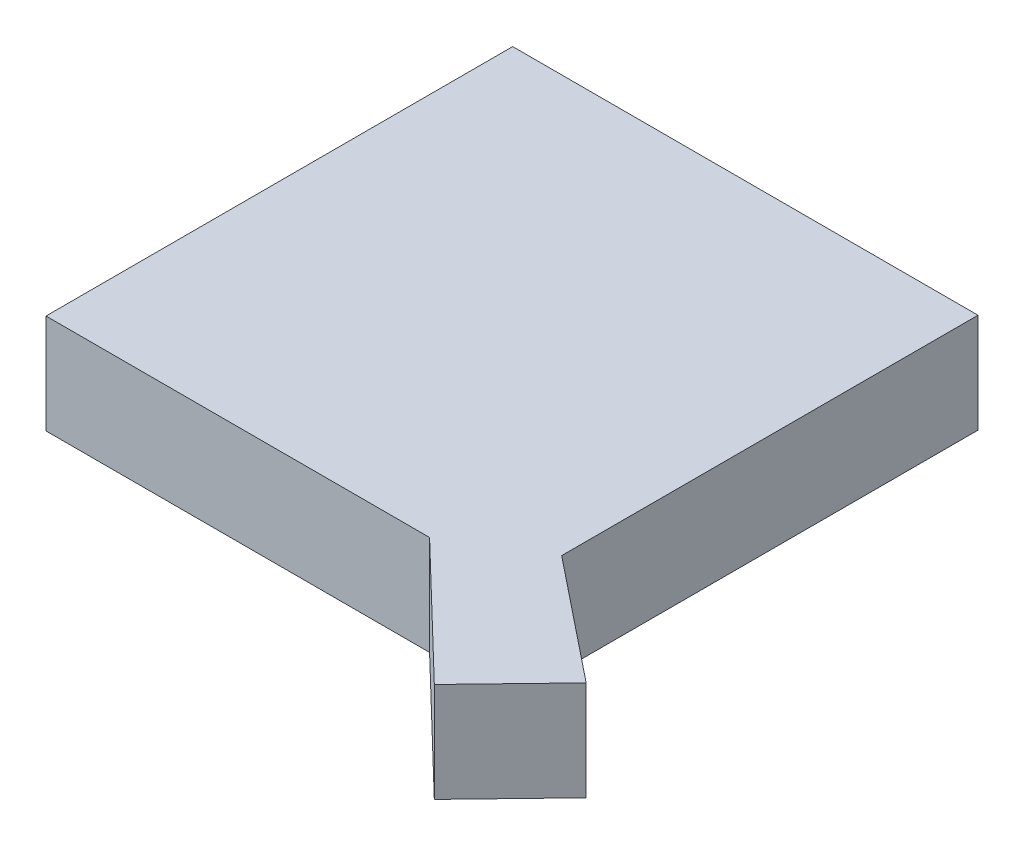
ISO-10303-21;
HEADER;
FILE_DESCRIPTION(('STEP AP214'),'2;1');
FILE_NAME('part.step','',(''),(''),'','','');
FILE_SCHEMA(('AUTOMOTIVE_DESIGN { 1 0 10303 214 1 1 1 1 }'));
ENDSEC;
DATA;
#1=APPLICATION_CONTEXT('core data for automotive mechanical design processes');
#2=APPLICATION_PROTOCOL_DEFINITION('international standard','automotive_design',2000,#1);
#3=PRODUCT_CONTEXT('',#1,'mechanical');
#4=PRODUCT('Part','Part','',(#3));
#5=PRODUCT_RELATED_PRODUCT_CATEGORY('part','',(#4));
#6=PRODUCT_DEFINITION_FORMATION('','',#4);
#7=PRODUCT_DEFINITION_CONTEXT('part definition',#1,'design');
#8=PRODUCT_DEFINITION('design','',#6,#7);
#9=PRODUCT_DEFINITION_SHAPE('','',#8);
#10=(LENGTH_UNIT() NAMED_UNIT(*) SI_UNIT(.MILLI.,.METRE.));
#11=(NAMED_UNIT(*) PLANE_ANGLE_UNIT() SI_UNIT($,.RADIAN.));
#12=(NAMED_UNIT(*) SI_UNIT($,.STERADIAN.) SOLID_ANGLE_UNIT());
#13=UNCERTAINTY_MEASURE_WITH_UNIT(LENGTH_MEASURE(1.E-05),#10,'distance_accuracy_value','');
#14=(GEOMETRIC_REPRESENTATION_CONTEXT(3) GLOBAL_UNCERTAINTY_ASSIGNED_CONTEXT((#13)) GLOBAL_UNIT_ASSIGNED_CONTEXT((#10,
#11,#12)) REPRESENTATION_CONTEXT('',''));
#15=CARTESIAN_POINT('',(0.,0.,0.));
#16=DIRECTION('',(0.,0.,1.));
#17=DIRECTION('',(1.,0.,0.));
#18=AXIS2_PLACEMENT_3D('',#15,#16,#17);
#19=CARTESIAN_POINT('',(38.5326085246113,10.,0.));
#20=DIRECTION('',(0.,0.,-1.));
#21=DIRECTION('',(-1.,0.,0.));
#22=AXIS2_PLACEMENT_3D('',#19,#20,#21);
#23=PLANE('',#22);
#24=DIRECTION('',(1.,0.,0.));
#25=VECTOR('',#24,1.);
#26=CARTESIAN_POINT('',(38.5326085246113,0.,0.));
#27=LINE('',#26,#25);
#28=CARTESIAN_POINT('',(0.,0.,0.));
#29=VERTEX_POINT('',#28);
#30=CARTESIAN_POINT('',(38.5326085246113,0.,0.));
#31=VERTEX_POINT('',#30);
#32=EDGE_CURVE('E123',#29,#31,#27,.T.);
#33=ORIENTED_EDGE('',*,*,#32,.T.);
#34=DIRECTION('',(0.,-1.,0.));
#35=VECTOR('',#34,1.);
#36=CARTESIAN_POINT('',(38.5326085246113,10.,0.));
#37=LINE('',#36,#35);
#38=CARTESIAN_POINT('',(38.5326085246113,10.,0.));
#39=VERTEX_POINT('',#38);
#40=EDGE_CURVE('E11',#39,#31,#37,.T.);
#41=ORIENTED_EDGE('',*,*,#40,.F.);
#42=DIRECTION('',(1.,0.,0.));
#43=VECTOR('',#42,1.);
#44=CARTESIAN_POINT('',(38.5326085246113,10.,0.));
#45=LINE('',#44,#43);
#46=CARTESIAN_POINT('',(0.,10.,0.));
#47=VERTEX_POINT('',#46);
#48=EDGE_CURVE('E135',#47,#39,#45,.T.);
#49=ORIENTED_EDGE('',*,*,#48,.F.);
#50=DIRECTION('',(0.,-1.,0.));
#51=VECTOR('',#50,1.);
#52=CARTESIAN_POINT('',(0.,10.,0.));
#53=LINE('',#52,#51);
#54=EDGE_CURVE('E119',#47,#29,#53,.T.);
#55=ORIENTED_EDGE('',*,*,#54,.T.);
#56=EDGE_LOOP('',(#33,#41,#49,#55));
#57=FACE_BOUND('',#56,.T.);
#58=ADVANCED_FACE('F33',(#57),#23,.F.);
#59=CARTESIAN_POINT('',(51.5617212995141,10.,12.5523797791142));
#60=DIRECTION('',(0.693808773732824,0.,-0.720159277862442));
#61=DIRECTION('',(-0.720159277862442,0.,-0.693808773732824));
#62=AXIS2_PLACEMENT_3D('',#59,#60,#61);
#63=PLANE('',#62);
#64=DIRECTION('',(0.720159277862442,0.,0.693808773732824));
#65=VECTOR('',#64,1.);
#66=CARTESIAN_POINT('',(51.5617212995141,0.,12.5523797791142));
#67=LINE('',#66,#65);
#68=CARTESIAN_POINT('',(51.5617212995141,0.,12.5523797791142));
#69=VERTEX_POINT('',#68);
#70=EDGE_CURVE('E126',#31,#69,#67,.T.);
#71=ORIENTED_EDGE('',*,*,#70,.T.);
#72=DIRECTION('',(0.,-1.,0.));
#73=VECTOR('',#72,1.);
#74=CARTESIAN_POINT('',(51.5617212995141,10.,12.5523797791142));
#75=LINE('',#74,#73);
#76=CARTESIAN_POINT('',(51.5617212995141,10.,12.5523797791142));
#77=VERTEX_POINT('',#76);
#78=EDGE_CURVE('E41',#77,#69,#75,.T.);
#79=ORIENTED_EDGE('',*,*,#78,.F.);
#80=DIRECTION('',(0.720159277862442,0.,0.693808773732824));
#81=VECTOR('',#80,1.);
#82=CARTESIAN_POINT('',(51.5617212995141,10.,12.5523797791142));
#83=LINE('',#82,#81);
#84=EDGE_CURVE('E89',#39,#77,#83,.T.);
#85=ORIENTED_EDGE('',*,*,#84,.F.);
#86=ORIENTED_EDGE('',*,*,#40,.T.);
#87=EDGE_LOOP('',(#71,#79,#85,#86));
#88=FACE_BOUND('',#87,.T.);
#89=ADVANCED_FACE('F160',(#88),#63,.F.);
#90=CARTESIAN_POINT('',(59.0460290778687,10.,4.7838218002903));
#91=DIRECTION('',(-0.720159277862443,0.,-0.693808773732824));
#92=DIRECTION('',(-0.693808773732824,0.,0.720159277862443));
#93=AXIS2_PLACEMENT_3D('',#90,#91,#92);
#94=PLANE('',#93);
#95=DIRECTION('',(0.693808773732824,0.,-0.720159277862443));
#96=VECTOR('',#95,1.);
#97=CARTESIAN_POINT('',(59.0460290778687,0.,4.7838218002903));
#98=LINE('',#97,#96);
#99=CARTESIAN_POINT('',(59.0460290778687,0.,4.7838218002903));
#100=VERTEX_POINT('',#99);
#101=EDGE_CURVE('E128',#69,#100,#98,.T.);
#102=ORIENTED_EDGE('',*,*,#101,.T.);
#103=DIRECTION('',(0.,-1.,0.));
#104=VECTOR('',#103,1.);
#105=CARTESIAN_POINT('',(59.0460290778687,10.,4.7838218002903));
#106=LINE('',#105,#104);
#107=CARTESIAN_POINT('',(59.0460290778687,10.,4.7838218002903));
#108=VERTEX_POINT('',#107);
#109=EDGE_CURVE('E139',#108,#100,#106,.T.);
#110=ORIENTED_EDGE('',*,*,#109,.F.);
#111=DIRECTION('',(0.693808773732824,0.,-0.720159277862443));
#112=VECTOR('',#111,1.);
#113=CARTESIAN_POINT('',(59.0460290778687,10.,4.7838218002903));
#114=LINE('',#113,#112);
#115=EDGE_CURVE('E147',#77,#108,#114,.T.);
#116=ORIENTED_EDGE('',*,*,#115,.F.);
#117=ORIENTED_EDGE('',*,*,#78,.T.);
#118=EDGE_LOOP('',(#102,#110,#116,#117));
#119=FACE_BOUND('',#118,.T.);
#120=ADVANCED_FACE('F145',(#119),#94,.F.);
#121=CARTESIAN_POINT('',(46.7447730199794,10.,-5.05718304602115));
#122=DIRECTION('',(-0.624695047554425,0.,0.78086880944303));
#123=DIRECTION('',(0.78086880944303,0.,0.624695047554425));
#124=AXIS2_PLACEMENT_3D('',#121,#122,#123);
#125=PLANE('',#124);
#126=DIRECTION('',(-0.78086880944303,0.,-0.624695047554425));
#127=VECTOR('',#126,1.);
#128=CARTESIAN_POINT('',(46.7447730199794,0.,-5.05718304602115));
#129=LINE('',#128,#127);
#130=CARTESIAN_POINT('',(46.7447730199794,0.,-5.05718304602115));
#131=VERTEX_POINT('',#130);
#132=EDGE_CURVE('E130',#100,#131,#129,.T.);
#133=ORIENTED_EDGE('',*,*,#132,.T.);
#134=DIRECTION('',(0.,-1.,0.));
#135=VECTOR('',#134,1.);
#136=CARTESIAN_POINT('',(46.7447730199794,10.,-5.05718304602115));
#137=LINE('',#136,#135);
#138=CARTESIAN_POINT('',(46.7447730199794,10.,-5.05718304602115));
#139=VERTEX_POINT('',#138);
#140=EDGE_CURVE('E114',#139,#131,#137,.T.);
#141=ORIENTED_EDGE('',*,*,#140,.F.);
#142=DIRECTION('',(-0.78086880944303,0.,-0.624695047554425));
#143=VECTOR('',#142,1.);
#144=CARTESIAN_POINT('',(46.7447730199794,10.,-5.05718304602115));
#145=LINE('',#144,#143);
#146=EDGE_CURVE('E105',#108,#139,#145,.T.);
#147=ORIENTED_EDGE('',*,*,#146,.F.);
#148=ORIENTED_EDGE('',*,*,#109,.T.);
#149=EDGE_LOOP('',(#133,#141,#147,#148));
#150=FACE_BOUND('',#149,.T.);
#151=ADVANCED_FACE('F153',(#150),#125,.F.);
#152=CARTESIAN_POINT('',(46.7447730199794,10.,-46.8814536428449));
#153=DIRECTION('',(-1.,0.,0.));
#154=DIRECTION('',(0.,0.,1.));
#155=AXIS2_PLACEMENT_3D('',#152,#153,#154);
#156=PLANE('',#155);
#157=DIRECTION('',(0.,0.,-1.));
#158=VECTOR('',#157,1.);
#159=CARTESIAN_POINT('',(46.7447730199794,0.,-46.8814536428449));
#160=LINE('',#159,#158);
#161=CARTESIAN_POINT('',(46.7447730199794,0.,-46.8814536428449));
#162=VERTEX_POINT('',#161);
#163=EDGE_CURVE('E113',#131,#162,#160,.T.);
#164=ORIENTED_EDGE('',*,*,#163,.T.);
#165=DIRECTION('',(0.,-1.,0.));
#166=VECTOR('',#165,1.);
#167=CARTESIAN_POINT('',(46.7447730199794,10.,-46.8814536428449));
#168=LINE('',#167,#166);
#169=CARTESIAN_POINT('',(46.7447730199794,10.,-46.8814536428449));
#170=VERTEX_POINT('',#169);
#171=EDGE_CURVE('E110',#170,#162,#168,.T.);
#172=ORIENTED_EDGE('',*,*,#171,.F.);
#173=DIRECTION('',(0.,0.,-1.));
#174=VECTOR('',#173,1.);
#175=CARTESIAN_POINT('',(46.7447730199794,10.,-46.8814536428449));
#176=LINE('',#175,#174);
#177=EDGE_CURVE('E99',#139,#170,#176,.T.);
#178=ORIENTED_EDGE('',*,*,#177,.F.);
#179=ORIENTED_EDGE('',*,*,#140,.T.);
#180=EDGE_LOOP('',(#164,#172,#178,#179));
#181=FACE_BOUND('',#180,.T.);
#182=ADVANCED_FACE('F111',(#181),#156,.F.);
#183=CARTESIAN_POINT('',(0.,10.,-46.8814536428449));
#184=DIRECTION('',(0.,0.,1.));
#185=DIRECTION('',(1.,0.,0.));
#186=AXIS2_PLACEMENT_3D('',#183,#184,#185);
#187=PLANE('',#186);
#188=DIRECTION('',(-1.,0.,0.));
#189=VECTOR('',#188,1.);
#190=CARTESIAN_POINT('',(0.,0.,-46.8814536428449));
#191=LINE('',#190,#189);
#192=CARTESIAN_POINT('',(0.,0.,-46.8814536428449));
#193=VERTEX_POINT('',#192);
#194=EDGE_CURVE('E75',#162,#193,#191,.T.);
#195=ORIENTED_EDGE('',*,*,#194,.T.);
#196=DIRECTION('',(0.,-1.,0.));
#197=VECTOR('',#196,1.);
#198=CARTESIAN_POINT('',(0.,10.,-46.8814536428449));
#199=LINE('',#198,#197);
#200=CARTESIAN_POINT('',(0.,10.,-46.8814536428449));
#201=VERTEX_POINT('',#200);
#202=EDGE_CURVE('E115',#201,#193,#199,.T.);
#203=ORIENTED_EDGE('',*,*,#202,.F.);
#204=DIRECTION('',(-1.,0.,0.));
#205=VECTOR('',#204,1.);
#206=CARTESIAN_POINT('',(0.,10.,-46.8814536428449));
#207=LINE('',#206,#205);
#208=EDGE_CURVE('E103',#170,#201,#207,.T.);
#209=ORIENTED_EDGE('',*,*,#208,.F.);
#210=ORIENTED_EDGE('',*,*,#171,.T.);
#211=EDGE_LOOP('',(#195,#203,#209,#210));
#212=FACE_BOUND('',#211,.T.);
#213=ADVANCED_FACE('F117',(#212),#187,.F.);
#214=CARTESIAN_POINT('',(0.,10.,0.));
#215=DIRECTION('',(1.,0.,0.));
#216=DIRECTION('',(0.,0.,-1.));
#217=AXIS2_PLACEMENT_3D('',#214,#215,#216);
#218=PLANE('',#217);
#219=DIRECTION('',(0.,0.,1.));
#220=VECTOR('',#219,1.);
#221=CARTESIAN_POINT('',(0.,0.,0.));
#222=LINE('',#221,#220);
#223=EDGE_CURVE('E81',#193,#29,#222,.T.);
#224=ORIENTED_EDGE('',*,*,#223,.T.);
#225=ORIENTED_EDGE('',*,*,#54,.F.);
#226=DIRECTION('',(0.,0.,1.));
#227=VECTOR('',#226,1.);
#228=CARTESIAN_POINT('',(0.,10.,0.));
#229=LINE('',#228,#227);
#230=EDGE_CURVE('E49',#201,#47,#229,.T.);
#231=ORIENTED_EDGE('',*,*,#230,.F.);
#232=ORIENTED_EDGE('',*,*,#202,.T.);
#233=EDGE_LOOP('',(#224,#225,#231,#232));
#234=FACE_BOUND('',#233,.T.);
#235=ADVANCED_FACE('F174',(#234),#218,.F.);
#236=CARTESIAN_POINT('',(0.,10.,0.));
#237=DIRECTION('',(0.,-1.,0.));
#238=DIRECTION('',(0.,0.,-1.));
#239=AXIS2_PLACEMENT_3D('',#236,#237,#238);
#240=PLANE('',#239);
#241=ORIENTED_EDGE('',*,*,#48,.T.);
#242=ORIENTED_EDGE('',*,*,#84,.T.);
#243=ORIENTED_EDGE('',*,*,#115,.T.);
#244=ORIENTED_EDGE('',*,*,#146,.T.);
#245=ORIENTED_EDGE('',*,*,#177,.T.);
#246=ORIENTED_EDGE('',*,*,#208,.T.);
#247=ORIENTED_EDGE('',*,*,#230,.T.);
#248=EDGE_LOOP('',(#241,#242,#243,#244,#245,#246,#247));
#249=FACE_BOUND('',#248,.T.);
#250=ADVANCED_FACE('F101',(#249),#240,.F.);
#251=CARTESIAN_POINT('',(0.,0.,0.));
#252=DIRECTION('',(0.,-1.,0.));
#253=DIRECTION('',(0.,0.,-1.));
#254=AXIS2_PLACEMENT_3D('',#251,#252,#253);
#255=PLANE('',#254);
#256=ORIENTED_EDGE('',*,*,#32,.F.);
#257=ORIENTED_EDGE('',*,*,#223,.F.);
#258=ORIENTED_EDGE('',*,*,#194,.F.);
#259=ORIENTED_EDGE('',*,*,#163,.F.);
#260=ORIENTED_EDGE('',*,*,#132,.F.);
#261=ORIENTED_EDGE('',*,*,#101,.F.);
#262=ORIENTED_EDGE('',*,*,#70,.F.);
#263=EDGE_LOOP('',(#256,#257,#258,#259,#260,#261,#262));
#264=FACE_BOUND('',#263,.T.);
#265=ADVANCED_FACE('F151',(#264),#255,.T.);
#266=CLOSED_SHELL('',(#58,#89,#120,#151,#182,#213,#235,#250,#265));
#267=MANIFOLD_SOLID_BREP('B2',#266);
#268=ADVANCED_BREP_SHAPE_REPRESENTATION('',(#18,#267),#14);
#269=SHAPE_DEFINITION_REPRESENTATION(#9,#268);
ENDSEC;
END-ISO-10303-21;
